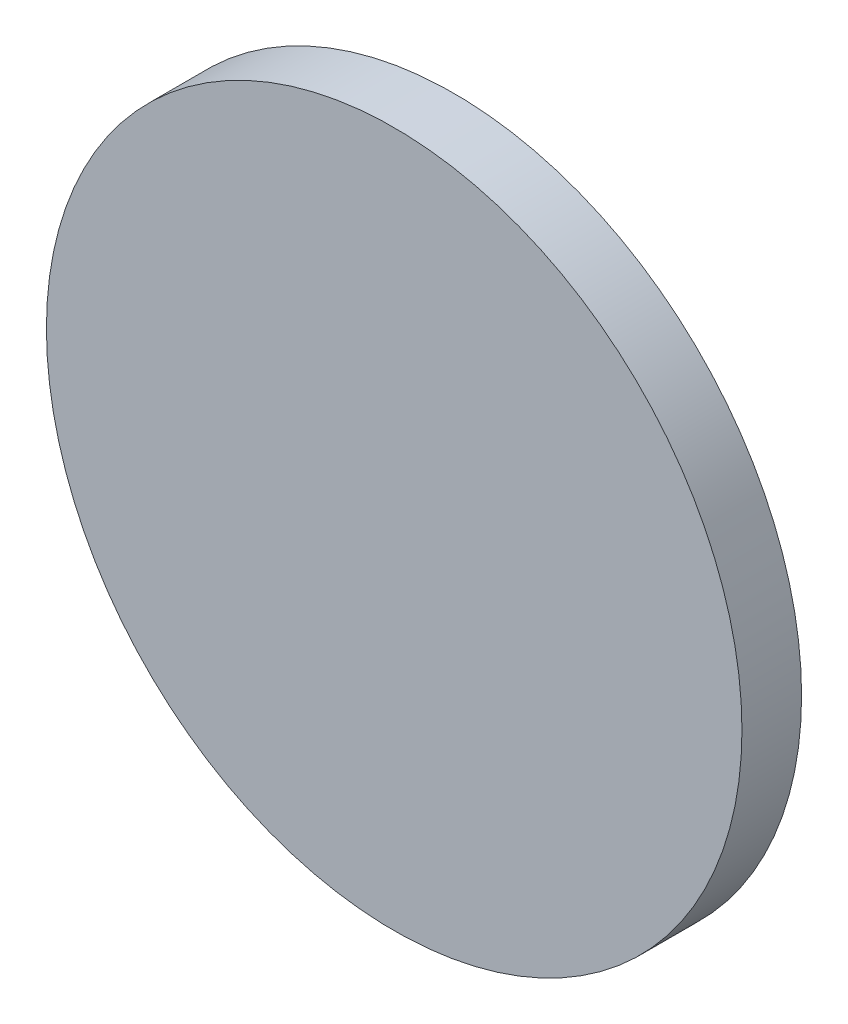
ISO-10303-21;
HEADER;
FILE_DESCRIPTION(('STEP AP214'),'2;1');
FILE_NAME('part.step','',(''),(''),'','','');
FILE_SCHEMA(('AUTOMOTIVE_DESIGN { 1 0 10303 214 1 1 1 1 }'));
ENDSEC;
DATA;
#1=APPLICATION_CONTEXT('core data for automotive mechanical design processes');
#2=APPLICATION_PROTOCOL_DEFINITION('international standard','automotive_design',2000,#1);
#3=PRODUCT_CONTEXT('',#1,'mechanical');
#4=PRODUCT('Part','Part','',(#3));
#5=PRODUCT_RELATED_PRODUCT_CATEGORY('part','',(#4));
#6=PRODUCT_DEFINITION_FORMATION('','',#4);
#7=PRODUCT_DEFINITION_CONTEXT('part definition',#1,'design');
#8=PRODUCT_DEFINITION('design','',#6,#7);
#9=PRODUCT_DEFINITION_SHAPE('','',#8);
#10=(LENGTH_UNIT() NAMED_UNIT(*) SI_UNIT(.MILLI.,.METRE.));
#11=(NAMED_UNIT(*) PLANE_ANGLE_UNIT() SI_UNIT($,.RADIAN.));
#12=(NAMED_UNIT(*) SI_UNIT($,.STERADIAN.) SOLID_ANGLE_UNIT());
#13=UNCERTAINTY_MEASURE_WITH_UNIT(LENGTH_MEASURE(1.E-05),#10,'distance_accuracy_value','');
#14=(GEOMETRIC_REPRESENTATION_CONTEXT(3) GLOBAL_UNCERTAINTY_ASSIGNED_CONTEXT((#13)) GLOBAL_UNIT_ASSIGNED_CONTEXT((#10,
#11,#12)) REPRESENTATION_CONTEXT('',''));
#15=CARTESIAN_POINT('',(0.,0.,0.));
#16=DIRECTION('',(0.,0.,1.));
#17=DIRECTION('',(1.,0.,0.));
#18=AXIS2_PLACEMENT_3D('',#15,#16,#17);
#19=CARTESIAN_POINT('',(8.42518,1.648460006176,0.76487));
#20=DIRECTION('',(0.,0.,-1.));
#21=DIRECTION('',(-1.,0.,0.));
#22=AXIS2_PLACEMENT_3D('',#19,#20,#21);
#23=PLANE('',#22);
#24=CARTESIAN_POINT('',(8.42518,1.648460006176,0.76487));
#25=DIRECTION('',(0.,0.,1.));
#26=DIRECTION('',(1.,0.,0.));
#27=AXIS2_PLACEMENT_3D('',#24,#25,#26);
#28=CIRCLE('',#27,0.200024667);
#29=CARTESIAN_POINT('',(8.625204667,1.648460006176,0.76487));
#30=VERTEX_POINT('',#29);
#31=EDGE_CURVE('E18',#30,#30,#28,.T.);
#32=ORIENTED_EDGE('',*,*,#31,.F.);
#33=EDGE_LOOP('',(#32));
#34=FACE_BOUND('',#33,.T.);
#35=ADVANCED_FACE('F15',(#34),#23,.T.);
#36=CARTESIAN_POINT('',(8.42518,1.648460006176,0.76487));
#37=DIRECTION('',(0.,0.,1.));
#38=DIRECTION('',(1.,0.,0.));
#39=AXIS2_PLACEMENT_3D('',#36,#37,#38);
#40=CYLINDRICAL_SURFACE('',#39,0.200024667);
#41=CARTESIAN_POINT('',(8.42518,1.648460006176,0.79916));
#42=DIRECTION('',(0.,0.,1.));
#43=DIRECTION('',(1.,0.,0.));
#44=AXIS2_PLACEMENT_3D('',#41,#42,#43);
#45=CIRCLE('',#44,0.200024667);
#46=CARTESIAN_POINT('',(8.625204667,1.648460006176,0.79916));
#47=VERTEX_POINT('',#46);
#48=EDGE_CURVE('E10',#47,#47,#45,.T.);
#49=ORIENTED_EDGE('',*,*,#48,.F.);
#50=EDGE_LOOP('',(#49));
#51=FACE_BOUND('',#50,.T.);
#52=ORIENTED_EDGE('',*,*,#31,.T.);
#53=EDGE_LOOP('',(#52));
#54=FACE_BOUND('',#53,.T.);
#55=ADVANCED_FACE('F27',(#51,#54),#40,.T.);
#56=CARTESIAN_POINT('',(8.42518,1.648460006176,0.79916));
#57=DIRECTION('',(0.,0.,1.));
#58=DIRECTION('',(1.,0.,0.));
#59=AXIS2_PLACEMENT_3D('',#56,#57,#58);
#60=PLANE('',#59);
#61=ORIENTED_EDGE('',*,*,#48,.T.);
#62=EDGE_LOOP('',(#61));
#63=FACE_BOUND('',#62,.T.);
#64=ADVANCED_FACE('F34',(#63),#60,.T.);
#65=CLOSED_SHELL('',(#35,#55,#64));
#66=MANIFOLD_SOLID_BREP('B1',#65);
#67=ADVANCED_BREP_SHAPE_REPRESENTATION('',(#18,#66),#14);
#68=SHAPE_DEFINITION_REPRESENTATION(#9,#67);
ENDSEC;
END-ISO-10303-21;
